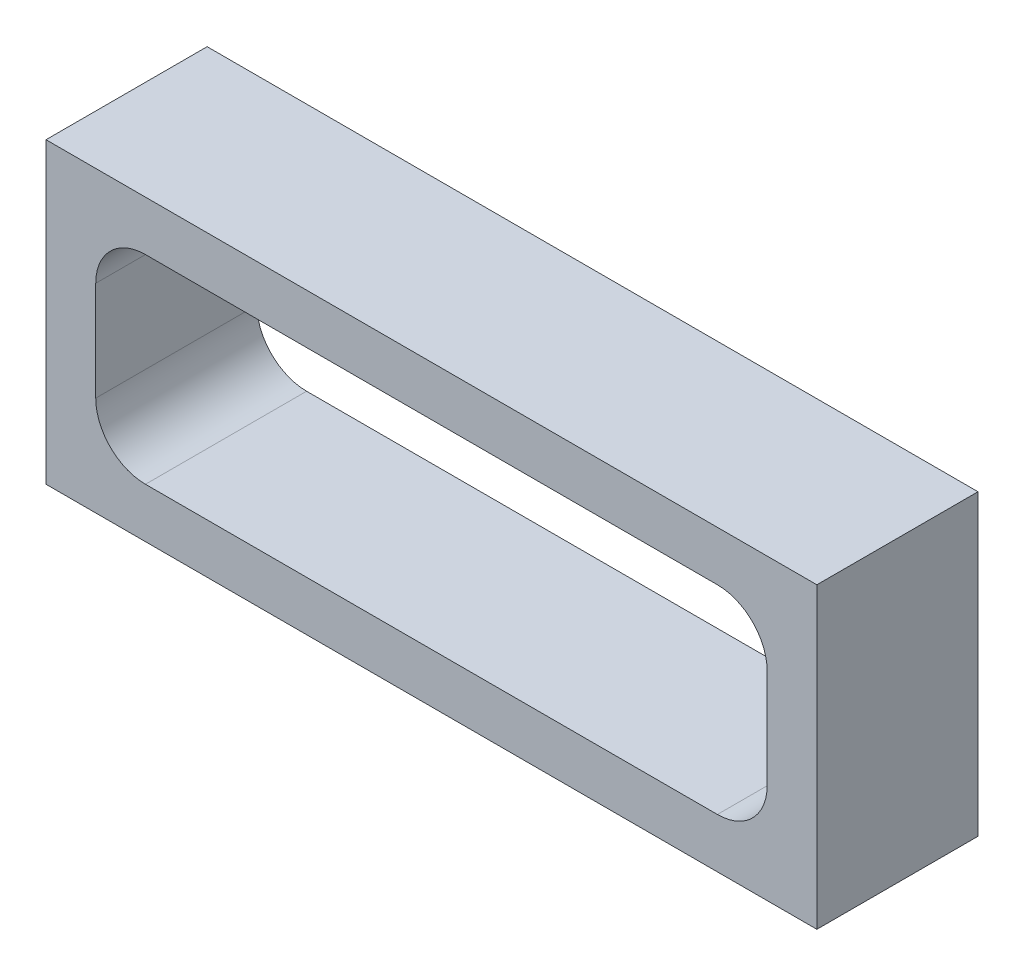
ISO-10303-21;
HEADER;
FILE_DESCRIPTION(('STEP AP214'),'2;1');
FILE_NAME('part.step','',(''),(''),'','','');
FILE_SCHEMA(('AUTOMOTIVE_DESIGN { 1 0 10303 214 1 1 1 1 }'));
ENDSEC;
DATA;
#1=APPLICATION_CONTEXT('core data for automotive mechanical design processes');
#2=APPLICATION_PROTOCOL_DEFINITION('international standard','automotive_design',2000,#1);
#3=PRODUCT_CONTEXT('',#1,'mechanical');
#4=PRODUCT('Part','Part','',(#3));
#5=PRODUCT_RELATED_PRODUCT_CATEGORY('part','',(#4));
#6=PRODUCT_DEFINITION_FORMATION('','',#4);
#7=PRODUCT_DEFINITION_CONTEXT('part definition',#1,'design');
#8=PRODUCT_DEFINITION('design','',#6,#7);
#9=PRODUCT_DEFINITION_SHAPE('','',#8);
#10=(LENGTH_UNIT() NAMED_UNIT(*) SI_UNIT(.MILLI.,.METRE.));
#11=(NAMED_UNIT(*) PLANE_ANGLE_UNIT() SI_UNIT($,.RADIAN.));
#12=(NAMED_UNIT(*) SI_UNIT($,.STERADIAN.) SOLID_ANGLE_UNIT());
#13=UNCERTAINTY_MEASURE_WITH_UNIT(LENGTH_MEASURE(1.E-05),#10,'distance_accuracy_value','');
#14=(GEOMETRIC_REPRESENTATION_CONTEXT(3) GLOBAL_UNCERTAINTY_ASSIGNED_CONTEXT((#13)) GLOBAL_UNIT_ASSIGNED_CONTEXT((#10,
#11,#12)) REPRESENTATION_CONTEXT('',''));
#15=CARTESIAN_POINT('',(0.,0.,0.));
#16=DIRECTION('',(0.,0.,1.));
#17=DIRECTION('',(1.,0.,0.));
#18=AXIS2_PLACEMENT_3D('',#15,#16,#17);
#19=CARTESIAN_POINT('',(-77.5,-30.,32.4));
#20=DIRECTION('',(1.,0.,0.));
#21=DIRECTION('',(0.,0.,-1.));
#22=AXIS2_PLACEMENT_3D('',#19,#20,#21);
#23=PLANE('',#22);
#24=DIRECTION('',(0.,0.,-1.));
#25=VECTOR('',#24,1.);
#26=CARTESIAN_POINT('',(-77.5,30.,16.2));
#27=LINE('',#26,#25);
#28=CARTESIAN_POINT('',(-77.5,30.,32.4));
#29=VERTEX_POINT('',#28);
#30=CARTESIAN_POINT('',(-77.5,30.,0.));
#31=VERTEX_POINT('',#30);
#32=EDGE_CURVE('E139',#29,#31,#27,.T.);
#33=ORIENTED_EDGE('',*,*,#32,.T.);
#34=DIRECTION('',(0.,-1.,0.));
#35=VECTOR('',#34,1.);
#36=CARTESIAN_POINT('',(-77.5,0.,0.));
#37=LINE('',#36,#35);
#38=CARTESIAN_POINT('',(-77.5,-30.,0.));
#39=VERTEX_POINT('',#38);
#40=EDGE_CURVE('E132',#31,#39,#37,.T.);
#41=ORIENTED_EDGE('',*,*,#40,.T.);
#42=DIRECTION('',(0.,0.,1.));
#43=VECTOR('',#42,1.);
#44=CARTESIAN_POINT('',(-77.5,-30.,16.2));
#45=LINE('',#44,#43);
#46=CARTESIAN_POINT('',(-77.5,-30.,32.4));
#47=VERTEX_POINT('',#46);
#48=EDGE_CURVE('E190',#39,#47,#45,.T.);
#49=ORIENTED_EDGE('',*,*,#48,.T.);
#50=DIRECTION('',(0.,-1.,0.));
#51=VECTOR('',#50,1.);
#52=CARTESIAN_POINT('',(-77.5,0.,32.4));
#53=LINE('',#52,#51);
#54=EDGE_CURVE('E170',#29,#47,#53,.T.);
#55=ORIENTED_EDGE('',*,*,#54,.F.);
#56=EDGE_LOOP('',(#33,#41,#49,#55));
#57=FACE_BOUND('',#56,.T.);
#58=ADVANCED_FACE('F17',(#57),#23,.F.);
#59=CARTESIAN_POINT('',(57.5,-10.,0.));
#60=DIRECTION('',(0.,0.,1.));
#61=DIRECTION('',(1.,0.,0.));
#62=AXIS2_PLACEMENT_3D('',#59,#60,#61);
#63=CYLINDRICAL_SURFACE('',#62,10.);
#64=CARTESIAN_POINT('',(57.5,-10.,32.4));
#65=DIRECTION('',(0.,0.,1.));
#66=DIRECTION('',(1.,0.,0.));
#67=AXIS2_PLACEMENT_3D('',#64,#65,#66);
#68=CIRCLE('',#67,10.);
#69=CARTESIAN_POINT('',(67.5000000025,-10.,32.4));
#70=VERTEX_POINT('',#69);
#71=CARTESIAN_POINT('',(57.5,-19.99999999,32.4));
#72=VERTEX_POINT('',#71);
#73=EDGE_CURVE('E168',#70,#72,#68,.F.);
#74=ORIENTED_EDGE('',*,*,#73,.F.);
#75=DIRECTION('',(0.,0.,-1.));
#76=VECTOR('',#75,1.);
#77=CARTESIAN_POINT('',(67.5,-10.,16.2));
#78=LINE('',#77,#76);
#79=CARTESIAN_POINT('',(67.5000000025,-10.,0.));
#80=VERTEX_POINT('',#79);
#81=EDGE_CURVE('E144',#70,#80,#78,.T.);
#82=ORIENTED_EDGE('',*,*,#81,.T.);
#83=CARTESIAN_POINT('',(57.5,-10.,0.));
#84=DIRECTION('',(0.,0.,1.));
#85=DIRECTION('',(1.,0.,0.));
#86=AXIS2_PLACEMENT_3D('',#83,#84,#85);
#87=CIRCLE('',#86,10.);
#88=CARTESIAN_POINT('',(57.5,-19.99999999,0.));
#89=VERTEX_POINT('',#88);
#90=EDGE_CURVE('E171',#80,#89,#87,.F.);
#91=ORIENTED_EDGE('',*,*,#90,.T.);
#92=DIRECTION('',(0.,0.,1.));
#93=VECTOR('',#92,1.);
#94=CARTESIAN_POINT('',(57.5,-20.,16.2));
#95=LINE('',#94,#93);
#96=EDGE_CURVE('E156',#89,#72,#95,.T.);
#97=ORIENTED_EDGE('',*,*,#96,.T.);
#98=EDGE_LOOP('',(#74,#82,#91,#97));
#99=FACE_BOUND('',#98,.T.);
#100=ADVANCED_FACE('F246',(#99),#63,.F.);
#101=CARTESIAN_POINT('',(-57.5,-20.,32.4));
#102=DIRECTION('',(0.,-1.,0.));
#103=DIRECTION('',(0.,0.,-1.));
#104=AXIS2_PLACEMENT_3D('',#101,#102,#103);
#105=PLANE('',#104);
#106=DIRECTION('',(0.,0.,1.));
#107=VECTOR('',#106,1.);
#108=CARTESIAN_POINT('',(-57.5000000038469,-20.,16.2));
#109=LINE('',#108,#107);
#110=CARTESIAN_POINT('',(-57.5000000019235,-19.99999999,32.4));
#111=VERTEX_POINT('',#110);
#112=CARTESIAN_POINT('',(-57.5000000019235,-19.99999999,0.));
#113=VERTEX_POINT('',#112);
#114=EDGE_CURVE('E105',#111,#113,#109,.F.);
#115=ORIENTED_EDGE('',*,*,#114,.F.);
#116=DIRECTION('',(-1.,0.,0.));
#117=VECTOR('',#116,1.);
#118=CARTESIAN_POINT('',(0.,-19.99999998,32.4));
#119=LINE('',#118,#117);
#120=EDGE_CURVE('E167',#72,#111,#119,.T.);
#121=ORIENTED_EDGE('',*,*,#120,.F.);
#122=ORIENTED_EDGE('',*,*,#96,.F.);
#123=DIRECTION('',(-1.,0.,0.));
#124=VECTOR('',#123,1.);
#125=CARTESIAN_POINT('',(0.,-19.99999998,0.));
#126=LINE('',#125,#124);
#127=EDGE_CURVE('E174',#89,#113,#126,.T.);
#128=ORIENTED_EDGE('',*,*,#127,.T.);
#129=EDGE_LOOP('',(#115,#121,#122,#128));
#130=FACE_BOUND('',#129,.T.);
#131=ADVANCED_FACE('F243',(#130),#105,.F.);
#132=CARTESIAN_POINT('',(-57.5,-10.,0.));
#133=DIRECTION('',(0.,0.,1.));
#134=DIRECTION('',(1.,0.,0.));
#135=AXIS2_PLACEMENT_3D('',#132,#133,#134);
#136=CYLINDRICAL_SURFACE('',#135,10.);
#137=CARTESIAN_POINT('',(-57.5,-10.,32.4));
#138=DIRECTION('',(0.,0.,1.));
#139=DIRECTION('',(1.,0.,0.));
#140=AXIS2_PLACEMENT_3D('',#137,#138,#139);
#141=CIRCLE('',#140,10.);
#142=CARTESIAN_POINT('',(-67.5000000025,-10.,32.4));
#143=VERTEX_POINT('',#142);
#144=EDGE_CURVE('E165',#111,#143,#141,.F.);
#145=ORIENTED_EDGE('',*,*,#144,.F.);
#146=ORIENTED_EDGE('',*,*,#114,.T.);
#147=CARTESIAN_POINT('',(-57.5,-10.,0.));
#148=DIRECTION('',(0.,0.,1.));
#149=DIRECTION('',(1.,0.,0.));
#150=AXIS2_PLACEMENT_3D('',#147,#148,#149);
#151=CIRCLE('',#150,10.);
#152=CARTESIAN_POINT('',(-67.5000000025,-10.,0.));
#153=VERTEX_POINT('',#152);
#154=EDGE_CURVE('E21',#113,#153,#151,.F.);
#155=ORIENTED_EDGE('',*,*,#154,.T.);
#156=DIRECTION('',(0.,0.,1.));
#157=VECTOR('',#156,1.);
#158=CARTESIAN_POINT('',(-67.5,-10.,16.2));
#159=LINE('',#158,#157);
#160=EDGE_CURVE('E112',#153,#143,#159,.T.);
#161=ORIENTED_EDGE('',*,*,#160,.T.);
#162=EDGE_LOOP('',(#145,#146,#155,#161));
#163=FACE_BOUND('',#162,.T.);
#164=ADVANCED_FACE('F131',(#163),#136,.F.);
#165=CARTESIAN_POINT('',(-67.5,-10.,0.));
#166=DIRECTION('',(-1.,0.,0.));
#167=DIRECTION('',(0.,0.,1.));
#168=AXIS2_PLACEMENT_3D('',#165,#166,#167);
#169=PLANE('',#168);
#170=DIRECTION('',(0.,0.,1.));
#171=VECTOR('',#170,1.);
#172=CARTESIAN_POINT('',(-67.5,9.99999999589793,16.2));
#173=LINE('',#172,#171);
#174=CARTESIAN_POINT('',(-67.5000000025,9.99999999794897,32.4));
#175=VERTEX_POINT('',#174);
#176=CARTESIAN_POINT('',(-67.5000000025,9.99999999794897,0.));
#177=VERTEX_POINT('',#176);
#178=EDGE_CURVE('E118',#175,#177,#173,.F.);
#179=ORIENTED_EDGE('',*,*,#178,.F.);
#180=DIRECTION('',(0.,1.,0.));
#181=VECTOR('',#180,1.);
#182=CARTESIAN_POINT('',(-67.500000005,0.,32.4));
#183=LINE('',#182,#181);
#184=EDGE_CURVE('E117',#143,#175,#183,.T.);
#185=ORIENTED_EDGE('',*,*,#184,.F.);
#186=ORIENTED_EDGE('',*,*,#160,.F.);
#187=DIRECTION('',(0.,1.,0.));
#188=VECTOR('',#187,1.);
#189=CARTESIAN_POINT('',(-67.500000005,0.,0.));
#190=LINE('',#189,#188);
#191=EDGE_CURVE('E116',#153,#177,#190,.T.);
#192=ORIENTED_EDGE('',*,*,#191,.T.);
#193=EDGE_LOOP('',(#179,#185,#186,#192));
#194=FACE_BOUND('',#193,.T.);
#195=ADVANCED_FACE('F115',(#194),#169,.F.);
#196=CARTESIAN_POINT('',(-57.5,10.,0.));
#197=DIRECTION('',(0.,0.,1.));
#198=DIRECTION('',(1.,0.,0.));
#199=AXIS2_PLACEMENT_3D('',#196,#197,#198);
#200=CYLINDRICAL_SURFACE('',#199,10.);
#201=CARTESIAN_POINT('',(-57.5,10.,32.4));
#202=DIRECTION('',(0.,0.,1.));
#203=DIRECTION('',(1.,0.,0.));
#204=AXIS2_PLACEMENT_3D('',#201,#202,#203);
#205=CIRCLE('',#204,10.);
#206=CARTESIAN_POINT('',(-57.5,19.99999999,32.4));
#207=VERTEX_POINT('',#206);
#208=EDGE_CURVE('E163',#175,#207,#205,.F.);
#209=ORIENTED_EDGE('',*,*,#208,.F.);
#210=ORIENTED_EDGE('',*,*,#178,.T.);
#211=CARTESIAN_POINT('',(-57.5,10.,0.));
#212=DIRECTION('',(0.,0.,1.));
#213=DIRECTION('',(1.,0.,0.));
#214=AXIS2_PLACEMENT_3D('',#211,#212,#213);
#215=CIRCLE('',#214,10.);
#216=CARTESIAN_POINT('',(-57.5,19.99999999,0.));
#217=VERTEX_POINT('',#216);
#218=EDGE_CURVE('E129',#177,#217,#215,.F.);
#219=ORIENTED_EDGE('',*,*,#218,.T.);
#220=DIRECTION('',(0.,0.,1.));
#221=VECTOR('',#220,1.);
#222=CARTESIAN_POINT('',(-57.5,20.,16.2));
#223=LINE('',#222,#221);
#224=EDGE_CURVE('E151',#217,#207,#223,.T.);
#225=ORIENTED_EDGE('',*,*,#224,.T.);
#226=EDGE_LOOP('',(#209,#210,#219,#225));
#227=FACE_BOUND('',#226,.T.);
#228=ADVANCED_FACE('F240',(#227),#200,.F.);
#229=CARTESIAN_POINT('',(-57.5,20.,0.));
#230=DIRECTION('',(0.,1.,0.));
#231=DIRECTION('',(0.,0.,1.));
#232=AXIS2_PLACEMENT_3D('',#229,#230,#231);
#233=PLANE('',#232);
#234=DIRECTION('',(0.,0.,1.));
#235=VECTOR('',#234,1.);
#236=CARTESIAN_POINT('',(57.499999997949,20.,16.2));
#237=LINE('',#236,#235);
#238=CARTESIAN_POINT('',(57.4999999989745,19.99999999,32.4));
#239=VERTEX_POINT('',#238);
#240=CARTESIAN_POINT('',(57.4999999989745,19.99999999,0.));
#241=VERTEX_POINT('',#240);
#242=EDGE_CURVE('E148',#239,#241,#237,.F.);
#243=ORIENTED_EDGE('',*,*,#242,.F.);
#244=DIRECTION('',(1.,0.,0.));
#245=VECTOR('',#244,1.);
#246=CARTESIAN_POINT('',(0.,19.99999998,32.4));
#247=LINE('',#246,#245);
#248=EDGE_CURVE('E162',#207,#239,#247,.T.);
#249=ORIENTED_EDGE('',*,*,#248,.F.);
#250=ORIENTED_EDGE('',*,*,#224,.F.);
#251=DIRECTION('',(1.,0.,0.));
#252=VECTOR('',#251,1.);
#253=CARTESIAN_POINT('',(0.,19.99999998,0.));
#254=LINE('',#253,#252);
#255=EDGE_CURVE('E178',#217,#241,#254,.T.);
#256=ORIENTED_EDGE('',*,*,#255,.T.);
#257=EDGE_LOOP('',(#243,#249,#250,#256));
#258=FACE_BOUND('',#257,.T.);
#259=ADVANCED_FACE('F237',(#258),#233,.F.);
#260=CARTESIAN_POINT('',(57.5,10.,0.));
#261=DIRECTION('',(0.,0.,1.));
#262=DIRECTION('',(1.,0.,0.));
#263=AXIS2_PLACEMENT_3D('',#260,#261,#262);
#264=CYLINDRICAL_SURFACE('',#263,10.);
#265=CARTESIAN_POINT('',(57.5,10.,32.4));
#266=DIRECTION('',(0.,0.,1.));
#267=DIRECTION('',(1.,0.,0.));
#268=AXIS2_PLACEMENT_3D('',#265,#266,#267);
#269=CIRCLE('',#268,10.);
#270=CARTESIAN_POINT('',(67.5000000025,10.,32.4));
#271=VERTEX_POINT('',#270);
#272=EDGE_CURVE('E159',#239,#271,#269,.F.);
#273=ORIENTED_EDGE('',*,*,#272,.F.);
#274=ORIENTED_EDGE('',*,*,#242,.T.);
#275=CARTESIAN_POINT('',(57.5,10.,0.));
#276=DIRECTION('',(0.,0.,1.));
#277=DIRECTION('',(1.,0.,0.));
#278=AXIS2_PLACEMENT_3D('',#275,#276,#277);
#279=CIRCLE('',#278,10.);
#280=CARTESIAN_POINT('',(67.5000000025,10.,0.));
#281=VERTEX_POINT('',#280);
#282=EDGE_CURVE('E176',#241,#281,#279,.F.);
#283=ORIENTED_EDGE('',*,*,#282,.T.);
#284=DIRECTION('',(0.,0.,1.));
#285=VECTOR('',#284,1.);
#286=CARTESIAN_POINT('',(67.5,10.,16.2));
#287=LINE('',#286,#285);
#288=EDGE_CURVE('E145',#281,#271,#287,.T.);
#289=ORIENTED_EDGE('',*,*,#288,.T.);
#290=EDGE_LOOP('',(#273,#274,#283,#289));
#291=FACE_BOUND('',#290,.T.);
#292=ADVANCED_FACE('F235',(#291),#264,.F.);
#293=CARTESIAN_POINT('',(67.5,-10.,32.4));
#294=DIRECTION('',(1.,0.,0.));
#295=DIRECTION('',(0.,0.,-1.));
#296=AXIS2_PLACEMENT_3D('',#293,#294,#295);
#297=PLANE('',#296);
#298=ORIENTED_EDGE('',*,*,#81,.F.);
#299=DIRECTION('',(0.,-1.,0.));
#300=VECTOR('',#299,1.);
#301=CARTESIAN_POINT('',(67.500000005,0.,32.4));
#302=LINE('',#301,#300);
#303=EDGE_CURVE('E161',#271,#70,#302,.T.);
#304=ORIENTED_EDGE('',*,*,#303,.F.);
#305=ORIENTED_EDGE('',*,*,#288,.F.);
#306=DIRECTION('',(0.,-1.,0.));
#307=VECTOR('',#306,1.);
#308=CARTESIAN_POINT('',(67.500000005,0.,0.));
#309=LINE('',#308,#307);
#310=EDGE_CURVE('E175',#281,#80,#309,.T.);
#311=ORIENTED_EDGE('',*,*,#310,.T.);
#312=EDGE_LOOP('',(#298,#304,#305,#311));
#313=FACE_BOUND('',#312,.T.);
#314=ADVANCED_FACE('F232',(#313),#297,.F.);
#315=CARTESIAN_POINT('',(-77.5,30.,32.4));
#316=DIRECTION('',(0.,-1.,0.));
#317=DIRECTION('',(0.,0.,-1.));
#318=AXIS2_PLACEMENT_3D('',#315,#316,#317);
#319=PLANE('',#318);
#320=DIRECTION('',(0.,0.,-1.));
#321=VECTOR('',#320,1.);
#322=CARTESIAN_POINT('',(77.5,30.,16.2));
#323=LINE('',#322,#321);
#324=CARTESIAN_POINT('',(77.5,30.,32.4));
#325=VERTEX_POINT('',#324);
#326=CARTESIAN_POINT('',(77.5,30.,0.));
#327=VERTEX_POINT('',#326);
#328=EDGE_CURVE('E202',#325,#327,#323,.T.);
#329=ORIENTED_EDGE('',*,*,#328,.T.);
#330=DIRECTION('',(-1.,0.,0.));
#331=VECTOR('',#330,1.);
#332=CARTESIAN_POINT('',(0.,30.,0.));
#333=LINE('',#332,#331);
#334=EDGE_CURVE('E133',#327,#31,#333,.T.);
#335=ORIENTED_EDGE('',*,*,#334,.T.);
#336=ORIENTED_EDGE('',*,*,#32,.F.);
#337=DIRECTION('',(-1.,0.,0.));
#338=VECTOR('',#337,1.);
#339=CARTESIAN_POINT('',(0.,30.,32.4));
#340=LINE('',#339,#338);
#341=EDGE_CURVE('E193',#325,#29,#340,.T.);
#342=ORIENTED_EDGE('',*,*,#341,.F.);
#343=EDGE_LOOP('',(#329,#335,#336,#342));
#344=FACE_BOUND('',#343,.T.);
#345=ADVANCED_FACE('F215',(#344),#319,.F.);
#346=CARTESIAN_POINT('',(-77.5,-30.,0.));
#347=DIRECTION('',(0.,0.,1.));
#348=DIRECTION('',(1.,0.,0.));
#349=AXIS2_PLACEMENT_3D('',#346,#347,#348);
#350=PLANE('',#349);
#351=ORIENTED_EDGE('',*,*,#90,.F.);
#352=ORIENTED_EDGE('',*,*,#310,.F.);
#353=ORIENTED_EDGE('',*,*,#282,.F.);
#354=ORIENTED_EDGE('',*,*,#255,.F.);
#355=ORIENTED_EDGE('',*,*,#218,.F.);
#356=ORIENTED_EDGE('',*,*,#191,.F.);
#357=ORIENTED_EDGE('',*,*,#154,.F.);
#358=ORIENTED_EDGE('',*,*,#127,.F.);
#359=EDGE_LOOP('',(#351,#352,#353,#354,#355,#356,#357,#358));
#360=FACE_BOUND('',#359,.T.);
#361=DIRECTION('',(-1.,0.,0.));
#362=VECTOR('',#361,1.);
#363=CARTESIAN_POINT('',(0.,-30.,0.));
#364=LINE('',#363,#362);
#365=CARTESIAN_POINT('',(77.5,-30.,0.));
#366=VERTEX_POINT('',#365);
#367=EDGE_CURVE('E187',#366,#39,#364,.T.);
#368=ORIENTED_EDGE('',*,*,#367,.T.);
#369=ORIENTED_EDGE('',*,*,#40,.F.);
#370=ORIENTED_EDGE('',*,*,#334,.F.);
#371=DIRECTION('',(0.,-1.,0.));
#372=VECTOR('',#371,1.);
#373=CARTESIAN_POINT('',(77.5,0.,0.));
#374=LINE('',#373,#372);
#375=EDGE_CURVE('E205',#327,#366,#374,.T.);
#376=ORIENTED_EDGE('',*,*,#375,.T.);
#377=EDGE_LOOP('',(#368,#369,#370,#376));
#378=FACE_BOUND('',#377,.T.);
#379=ADVANCED_FACE('F123',(#360,#378),#350,.F.);
#380=CARTESIAN_POINT('',(-77.5,-30.,0.));
#381=DIRECTION('',(0.,1.,0.));
#382=DIRECTION('',(0.,0.,1.));
#383=AXIS2_PLACEMENT_3D('',#380,#381,#382);
#384=PLANE('',#383);
#385=ORIENTED_EDGE('',*,*,#48,.F.);
#386=ORIENTED_EDGE('',*,*,#367,.F.);
#387=DIRECTION('',(0.,0.,1.));
#388=VECTOR('',#387,1.);
#389=CARTESIAN_POINT('',(77.5,-30.,16.2));
#390=LINE('',#389,#388);
#391=CARTESIAN_POINT('',(77.5,-30.,32.4));
#392=VERTEX_POINT('',#391);
#393=EDGE_CURVE('E27',#366,#392,#390,.T.);
#394=ORIENTED_EDGE('',*,*,#393,.T.);
#395=DIRECTION('',(1.,0.,0.));
#396=VECTOR('',#395,1.);
#397=CARTESIAN_POINT('',(0.,-30.,32.4));
#398=LINE('',#397,#396);
#399=EDGE_CURVE('E35',#47,#392,#398,.T.);
#400=ORIENTED_EDGE('',*,*,#399,.F.);
#401=EDGE_LOOP('',(#385,#386,#394,#400));
#402=FACE_BOUND('',#401,.T.);
#403=ADVANCED_FACE('F211',(#402),#384,.F.);
#404=CARTESIAN_POINT('',(77.5,-30.,32.4));
#405=DIRECTION('',(0.,0.,1.));
#406=DIRECTION('',(0.,1.,0.));
#407=AXIS2_PLACEMENT_3D('',#404,#405,#406);
#408=PLANE('',#407);
#409=ORIENTED_EDGE('',*,*,#272,.T.);
#410=ORIENTED_EDGE('',*,*,#303,.T.);
#411=ORIENTED_EDGE('',*,*,#73,.T.);
#412=ORIENTED_EDGE('',*,*,#120,.T.);
#413=ORIENTED_EDGE('',*,*,#144,.T.);
#414=ORIENTED_EDGE('',*,*,#184,.T.);
#415=ORIENTED_EDGE('',*,*,#208,.T.);
#416=ORIENTED_EDGE('',*,*,#248,.T.);
#417=EDGE_LOOP('',(#409,#410,#411,#412,#413,#414,#415,#416));
#418=FACE_BOUND('',#417,.T.);
#419=ORIENTED_EDGE('',*,*,#341,.T.);
#420=ORIENTED_EDGE('',*,*,#54,.T.);
#421=ORIENTED_EDGE('',*,*,#399,.T.);
#422=DIRECTION('',(0.,1.,0.));
#423=VECTOR('',#422,1.);
#424=CARTESIAN_POINT('',(77.5,0.,32.4));
#425=LINE('',#424,#423);
#426=EDGE_CURVE('E11',#392,#325,#425,.T.);
#427=ORIENTED_EDGE('',*,*,#426,.T.);
#428=EDGE_LOOP('',(#419,#420,#421,#427));
#429=FACE_BOUND('',#428,.T.);
#430=ADVANCED_FACE('F218',(#418,#429),#408,.T.);
#431=CARTESIAN_POINT('',(77.5,-30.,0.));
#432=DIRECTION('',(-1.,0.,0.));
#433=DIRECTION('',(0.,0.,1.));
#434=AXIS2_PLACEMENT_3D('',#431,#432,#433);
#435=PLANE('',#434);
#436=ORIENTED_EDGE('',*,*,#393,.F.);
#437=ORIENTED_EDGE('',*,*,#375,.F.);
#438=ORIENTED_EDGE('',*,*,#328,.F.);
#439=ORIENTED_EDGE('',*,*,#426,.F.);
#440=EDGE_LOOP('',(#436,#437,#438,#439));
#441=FACE_BOUND('',#440,.T.);
#442=ADVANCED_FACE('F19',(#441),#435,.F.);
#443=CLOSED_SHELL('',(#58,#100,#131,#164,#195,#228,#259,#292,#314,#345,#379,#403,#430,#442));
#444=MANIFOLD_SOLID_BREP('B1',#443);
#445=ADVANCED_BREP_SHAPE_REPRESENTATION('',(#18,#444),#14);
#446=SHAPE_DEFINITION_REPRESENTATION(#9,#445);
ENDSEC;
END-ISO-10303-21;
